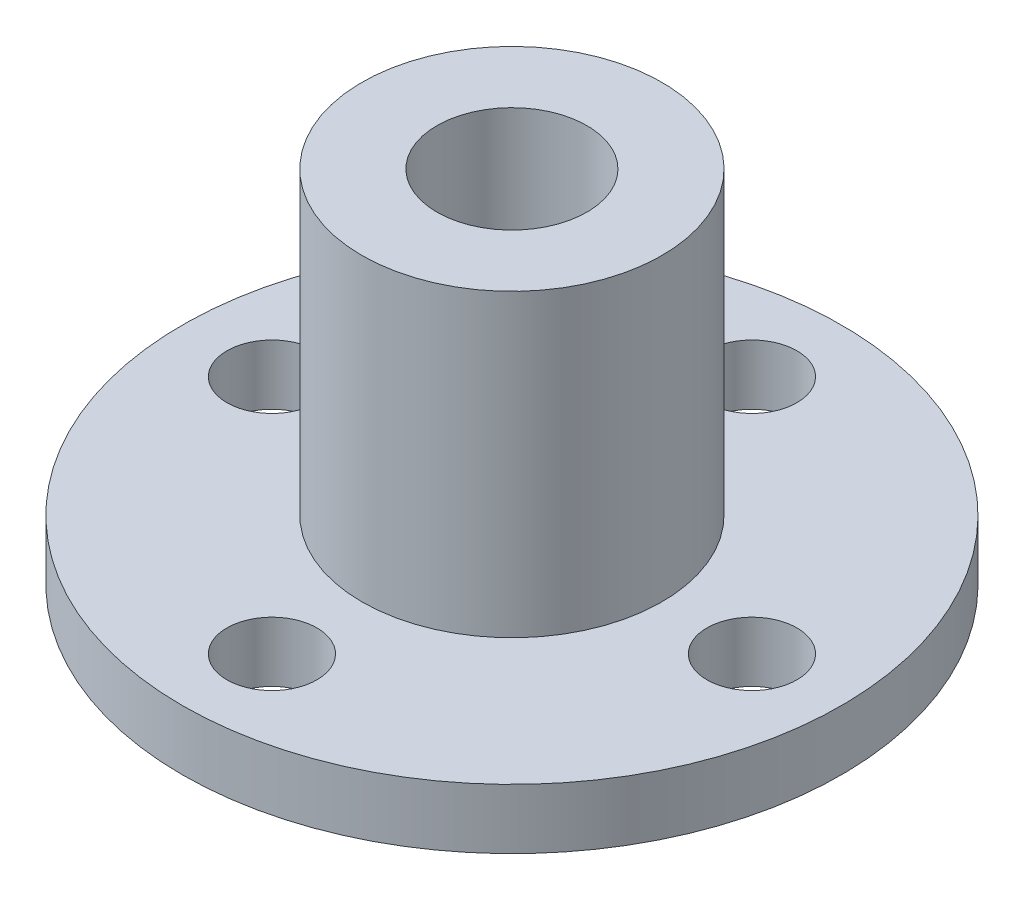
ISO-10303-21;
HEADER;
FILE_DESCRIPTION(('STEP AP214'),'2;1');
FILE_NAME('part.step','',(''),(''),'','','');
FILE_SCHEMA(('AUTOMOTIVE_DESIGN { 1 0 10303 214 1 1 1 1 }'));
ENDSEC;
DATA;
#1=APPLICATION_CONTEXT('core data for automotive mechanical design processes');
#2=APPLICATION_PROTOCOL_DEFINITION('international standard','automotive_design',2000,#1);
#3=PRODUCT_CONTEXT('',#1,'mechanical');
#4=PRODUCT('Part','Part','',(#3));
#5=PRODUCT_RELATED_PRODUCT_CATEGORY('part','',(#4));
#6=PRODUCT_DEFINITION_FORMATION('','',#4);
#7=PRODUCT_DEFINITION_CONTEXT('part definition',#1,'design');
#8=PRODUCT_DEFINITION('design','',#6,#7);
#9=PRODUCT_DEFINITION_SHAPE('','',#8);
#10=(LENGTH_UNIT() NAMED_UNIT(*) SI_UNIT(.MILLI.,.METRE.));
#11=(NAMED_UNIT(*) PLANE_ANGLE_UNIT() SI_UNIT($,.RADIAN.));
#12=(NAMED_UNIT(*) SI_UNIT($,.STERADIAN.) SOLID_ANGLE_UNIT());
#13=UNCERTAINTY_MEASURE_WITH_UNIT(LENGTH_MEASURE(1.E-05),#10,'distance_accuracy_value','');
#14=(GEOMETRIC_REPRESENTATION_CONTEXT(3) GLOBAL_UNCERTAINTY_ASSIGNED_CONTEXT((#13)) GLOBAL_UNIT_ASSIGNED_CONTEXT((#10,
#11,#12)) REPRESENTATION_CONTEXT('',''));
#15=CARTESIAN_POINT('',(0.,0.,0.));
#16=DIRECTION('',(0.,0.,1.));
#17=DIRECTION('',(1.,0.,0.));
#18=AXIS2_PLACEMENT_3D('',#15,#16,#17);
#19=CARTESIAN_POINT('',(0.,2.,0.));
#20=DIRECTION('',(0.,-1.,0.));
#21=DIRECTION('',(0.,0.,-1.));
#22=AXIS2_PLACEMENT_3D('',#19,#20,#21);
#23=CYLINDRICAL_SURFACE('',#22,10.9855);
#24=CARTESIAN_POINT('',(0.,2.,0.));
#25=DIRECTION('',(0.,1.,0.));
#26=DIRECTION('',(0.,0.,1.));
#27=AXIS2_PLACEMENT_3D('',#24,#25,#26);
#28=CIRCLE('',#27,10.9855);
#29=CARTESIAN_POINT('',(0.,2.,10.9855));
#30=VERTEX_POINT('',#29);
#31=EDGE_CURVE('E42',#30,#30,#28,.T.);
#32=ORIENTED_EDGE('',*,*,#31,.F.);
#33=EDGE_LOOP('',(#32));
#34=FACE_BOUND('',#33,.T.);
#35=CARTESIAN_POINT('',(0.,0.,0.));
#36=DIRECTION('',(0.,1.,0.));
#37=DIRECTION('',(0.,0.,1.));
#38=AXIS2_PLACEMENT_3D('',#35,#36,#37);
#39=CIRCLE('',#38,10.9855);
#40=CARTESIAN_POINT('',(0.,0.,10.9855));
#41=VERTEX_POINT('',#40);
#42=EDGE_CURVE('E47',#41,#41,#39,.T.);
#43=ORIENTED_EDGE('',*,*,#42,.T.);
#44=EDGE_LOOP('',(#43));
#45=FACE_BOUND('',#44,.T.);
#46=ADVANCED_FACE('F35',(#34,#45),#23,.T.);
#47=CARTESIAN_POINT('',(0.,2.,0.));
#48=DIRECTION('',(0.,1.,0.));
#49=DIRECTION('',(0.,0.,1.));
#50=AXIS2_PLACEMENT_3D('',#47,#48,#49);
#51=PLANE('',#50);
#52=CARTESIAN_POINT('',(8.,2.,0.));
#53=DIRECTION('',(0.,1.,0.));
#54=DIRECTION('',(0.,0.,1.));
#55=AXIS2_PLACEMENT_3D('',#52,#53,#54);
#56=CIRCLE('',#55,1.5);
#57=CARTESIAN_POINT('',(8.,2.,1.5));
#58=VERTEX_POINT('',#57);
#59=EDGE_CURVE('E59',#58,#58,#56,.T.);
#60=ORIENTED_EDGE('',*,*,#59,.F.);
#61=EDGE_LOOP('',(#60));
#62=FACE_BOUND('',#61,.T.);
#63=CARTESIAN_POINT('',(0.,2.,8.));
#64=DIRECTION('',(0.,1.,0.));
#65=DIRECTION('',(0.,0.,1.));
#66=AXIS2_PLACEMENT_3D('',#63,#64,#65);
#67=CIRCLE('',#66,1.5);
#68=CARTESIAN_POINT('',(0.,2.,9.5));
#69=VERTEX_POINT('',#68);
#70=EDGE_CURVE('E82',#69,#69,#67,.T.);
#71=ORIENTED_EDGE('',*,*,#70,.F.);
#72=EDGE_LOOP('',(#71));
#73=FACE_BOUND('',#72,.T.);
#74=CARTESIAN_POINT('',(-8.,2.,0.));
#75=DIRECTION('',(0.,1.,0.));
#76=DIRECTION('',(0.,0.,1.));
#77=AXIS2_PLACEMENT_3D('',#74,#75,#76);
#78=CIRCLE('',#77,1.5);
#79=CARTESIAN_POINT('',(-8.,2.,1.5));
#80=VERTEX_POINT('',#79);
#81=EDGE_CURVE('E79',#80,#80,#78,.T.);
#82=ORIENTED_EDGE('',*,*,#81,.F.);
#83=EDGE_LOOP('',(#82));
#84=FACE_BOUND('',#83,.T.);
#85=CARTESIAN_POINT('',(0.,2.,-8.));
#86=DIRECTION('',(0.,1.,0.));
#87=DIRECTION('',(0.,0.,1.));
#88=AXIS2_PLACEMENT_3D('',#85,#86,#87);
#89=CIRCLE('',#88,1.5);
#90=CARTESIAN_POINT('',(0.,2.,-6.5));
#91=VERTEX_POINT('',#90);
#92=EDGE_CURVE('E76',#91,#91,#89,.T.);
#93=ORIENTED_EDGE('',*,*,#92,.F.);
#94=EDGE_LOOP('',(#93));
#95=FACE_BOUND('',#94,.T.);
#96=CARTESIAN_POINT('',(0.,2.,0.));
#97=DIRECTION('',(0.,1.,0.));
#98=DIRECTION('',(0.,0.,1.));
#99=AXIS2_PLACEMENT_3D('',#96,#97,#98);
#100=CIRCLE('',#99,5.);
#101=CARTESIAN_POINT('',(0.,2.,5.));
#102=VERTEX_POINT('',#101);
#103=EDGE_CURVE('E10',#102,#102,#100,.T.);
#104=ORIENTED_EDGE('',*,*,#103,.F.);
#105=EDGE_LOOP('',(#104));
#106=FACE_BOUND('',#105,.T.);
#107=ORIENTED_EDGE('',*,*,#31,.T.);
#108=EDGE_LOOP('',(#107));
#109=FACE_BOUND('',#108,.T.);
#110=ADVANCED_FACE('F91',(#62,#73,#84,#95,#106,#109),#51,.T.);
#111=CARTESIAN_POINT('',(0.,0.,0.));
#112=DIRECTION('',(0.,1.,0.));
#113=DIRECTION('',(0.,0.,1.));
#114=AXIS2_PLACEMENT_3D('',#111,#112,#113);
#115=PLANE('',#114);
#116=CARTESIAN_POINT('',(8.,0.,0.));
#117=DIRECTION('',(0.,1.,0.));
#118=DIRECTION('',(0.,0.,1.));
#119=AXIS2_PLACEMENT_3D('',#116,#117,#118);
#120=CIRCLE('',#119,1.5);
#121=CARTESIAN_POINT('',(8.,0.,1.5));
#122=VERTEX_POINT('',#121);
#123=EDGE_CURVE('E38',#122,#122,#120,.T.);
#124=ORIENTED_EDGE('',*,*,#123,.T.);
#125=EDGE_LOOP('',(#124));
#126=FACE_BOUND('',#125,.T.);
#127=CARTESIAN_POINT('',(0.,0.,8.));
#128=DIRECTION('',(0.,1.,0.));
#129=DIRECTION('',(0.,0.,1.));
#130=AXIS2_PLACEMENT_3D('',#127,#128,#129);
#131=CIRCLE('',#130,1.5);
#132=CARTESIAN_POINT('',(0.,0.,9.5));
#133=VERTEX_POINT('',#132);
#134=EDGE_CURVE('E61',#133,#133,#131,.T.);
#135=ORIENTED_EDGE('',*,*,#134,.T.);
#136=EDGE_LOOP('',(#135));
#137=FACE_BOUND('',#136,.T.);
#138=CARTESIAN_POINT('',(-8.,0.,0.));
#139=DIRECTION('',(0.,1.,0.));
#140=DIRECTION('',(0.,0.,1.));
#141=AXIS2_PLACEMENT_3D('',#138,#139,#140);
#142=CIRCLE('',#141,1.5);
#143=CARTESIAN_POINT('',(-8.,0.,1.5));
#144=VERTEX_POINT('',#143);
#145=EDGE_CURVE('E58',#144,#144,#142,.T.);
#146=ORIENTED_EDGE('',*,*,#145,.T.);
#147=EDGE_LOOP('',(#146));
#148=FACE_BOUND('',#147,.T.);
#149=CARTESIAN_POINT('',(0.,0.,-8.));
#150=DIRECTION('',(0.,1.,0.));
#151=DIRECTION('',(0.,0.,1.));
#152=AXIS2_PLACEMENT_3D('',#149,#150,#151);
#153=CIRCLE('',#152,1.5);
#154=CARTESIAN_POINT('',(0.,0.,-6.5));
#155=VERTEX_POINT('',#154);
#156=EDGE_CURVE('E55',#155,#155,#153,.T.);
#157=ORIENTED_EDGE('',*,*,#156,.T.);
#158=EDGE_LOOP('',(#157));
#159=FACE_BOUND('',#158,.T.);
#160=CARTESIAN_POINT('',(0.,0.,0.));
#161=DIRECTION('',(0.,1.,0.));
#162=DIRECTION('',(0.,0.,1.));
#163=AXIS2_PLACEMENT_3D('',#160,#161,#162);
#164=CIRCLE('',#163,2.5);
#165=CARTESIAN_POINT('',(0.,0.,2.5));
#166=VERTEX_POINT('',#165);
#167=EDGE_CURVE('E70',#166,#166,#164,.T.);
#168=ORIENTED_EDGE('',*,*,#167,.T.);
#169=EDGE_LOOP('',(#168));
#170=FACE_BOUND('',#169,.T.);
#171=ORIENTED_EDGE('',*,*,#42,.F.);
#172=EDGE_LOOP('',(#171));
#173=FACE_BOUND('',#172,.T.);
#174=ADVANCED_FACE('F94',(#126,#137,#148,#159,#170,#173),#115,.F.);
#175=CARTESIAN_POINT('',(0.,12.,0.));
#176=DIRECTION('',(0.,-1.,0.));
#177=DIRECTION('',(0.,0.,-1.));
#178=AXIS2_PLACEMENT_3D('',#175,#176,#177);
#179=CYLINDRICAL_SURFACE('',#178,5.);
#180=CARTESIAN_POINT('',(0.,12.,0.));
#181=DIRECTION('',(0.,1.,0.));
#182=DIRECTION('',(0.,0.,1.));
#183=AXIS2_PLACEMENT_3D('',#180,#181,#182);
#184=CIRCLE('',#183,5.);
#185=CARTESIAN_POINT('',(0.,12.,5.));
#186=VERTEX_POINT('',#185);
#187=EDGE_CURVE('E50',#186,#186,#184,.T.);
#188=ORIENTED_EDGE('',*,*,#187,.F.);
#189=EDGE_LOOP('',(#188));
#190=FACE_BOUND('',#189,.T.);
#191=ORIENTED_EDGE('',*,*,#103,.T.);
#192=EDGE_LOOP('',(#191));
#193=FACE_BOUND('',#192,.T.);
#194=ADVANCED_FACE('F110',(#190,#193),#179,.T.);
#195=CARTESIAN_POINT('',(0.,12.,0.));
#196=DIRECTION('',(0.,1.,0.));
#197=DIRECTION('',(0.,0.,1.));
#198=AXIS2_PLACEMENT_3D('',#195,#196,#197);
#199=PLANE('',#198);
#200=CARTESIAN_POINT('',(0.,12.,0.));
#201=DIRECTION('',(0.,1.,0.));
#202=DIRECTION('',(0.,0.,1.));
#203=AXIS2_PLACEMENT_3D('',#200,#201,#202);
#204=CIRCLE('',#203,2.5);
#205=CARTESIAN_POINT('',(0.,12.,2.5));
#206=VERTEX_POINT('',#205);
#207=EDGE_CURVE('E66',#206,#206,#204,.T.);
#208=ORIENTED_EDGE('',*,*,#207,.F.);
#209=EDGE_LOOP('',(#208));
#210=FACE_BOUND('',#209,.T.);
#211=ORIENTED_EDGE('',*,*,#187,.T.);
#212=EDGE_LOOP('',(#211));
#213=FACE_BOUND('',#212,.T.);
#214=ADVANCED_FACE('F114',(#210,#213),#199,.T.);
#215=CARTESIAN_POINT('',(0.,0.,0.));
#216=DIRECTION('',(0.,1.,0.));
#217=DIRECTION('',(0.,0.,1.));
#218=AXIS2_PLACEMENT_3D('',#215,#216,#217);
#219=CYLINDRICAL_SURFACE('',#218,2.5);
#220=ORIENTED_EDGE('',*,*,#167,.F.);
#221=EDGE_LOOP('',(#220));
#222=FACE_BOUND('',#221,.T.);
#223=ORIENTED_EDGE('',*,*,#207,.T.);
#224=EDGE_LOOP('',(#223));
#225=FACE_BOUND('',#224,.T.);
#226=ADVANCED_FACE('F120',(#222,#225),#219,.F.);
#227=CARTESIAN_POINT('',(0.,-8.,-8.));
#228=DIRECTION('',(0.,1.,0.));
#229=DIRECTION('',(0.,0.,1.));
#230=AXIS2_PLACEMENT_3D('',#227,#228,#229);
#231=CYLINDRICAL_SURFACE('',#230,1.5);
#232=ORIENTED_EDGE('',*,*,#92,.T.);
#233=EDGE_LOOP('',(#232));
#234=FACE_BOUND('',#233,.T.);
#235=ORIENTED_EDGE('',*,*,#156,.F.);
#236=EDGE_LOOP('',(#235));
#237=FACE_BOUND('',#236,.T.);
#238=ADVANCED_FACE('F124',(#234,#237),#231,.F.);
#239=CARTESIAN_POINT('',(-8.,-8.,0.));
#240=DIRECTION('',(0.,1.,0.));
#241=DIRECTION('',(0.,0.,1.));
#242=AXIS2_PLACEMENT_3D('',#239,#240,#241);
#243=CYLINDRICAL_SURFACE('',#242,1.5);
#244=ORIENTED_EDGE('',*,*,#81,.T.);
#245=EDGE_LOOP('',(#244));
#246=FACE_BOUND('',#245,.T.);
#247=ORIENTED_EDGE('',*,*,#145,.F.);
#248=EDGE_LOOP('',(#247));
#249=FACE_BOUND('',#248,.T.);
#250=ADVANCED_FACE('F128',(#246,#249),#243,.F.);
#251=CARTESIAN_POINT('',(0.,-8.,8.));
#252=DIRECTION('',(0.,1.,0.));
#253=DIRECTION('',(0.,0.,1.));
#254=AXIS2_PLACEMENT_3D('',#251,#252,#253);
#255=CYLINDRICAL_SURFACE('',#254,1.5);
#256=ORIENTED_EDGE('',*,*,#70,.T.);
#257=EDGE_LOOP('',(#256));
#258=FACE_BOUND('',#257,.T.);
#259=ORIENTED_EDGE('',*,*,#134,.F.);
#260=EDGE_LOOP('',(#259));
#261=FACE_BOUND('',#260,.T.);
#262=ADVANCED_FACE('F132',(#258,#261),#255,.F.);
#263=CARTESIAN_POINT('',(8.,-8.,0.));
#264=DIRECTION('',(0.,1.,0.));
#265=DIRECTION('',(0.,0.,1.));
#266=AXIS2_PLACEMENT_3D('',#263,#264,#265);
#267=CYLINDRICAL_SURFACE('',#266,1.5);
#268=ORIENTED_EDGE('',*,*,#59,.T.);
#269=EDGE_LOOP('',(#268));
#270=FACE_BOUND('',#269,.T.);
#271=ORIENTED_EDGE('',*,*,#123,.F.);
#272=EDGE_LOOP('',(#271));
#273=FACE_BOUND('',#272,.T.);
#274=ADVANCED_FACE('F88',(#270,#273),#267,.F.);
#275=CLOSED_SHELL('',(#46,#110,#174,#194,#214,#226,#238,#250,#262,#274));
#276=MANIFOLD_SOLID_BREP('B2',#275);
#277=ADVANCED_BREP_SHAPE_REPRESENTATION('',(#18,#276),#14);
#278=SHAPE_DEFINITION_REPRESENTATION(#9,#277);
ENDSEC;
END-ISO-10303-21;
